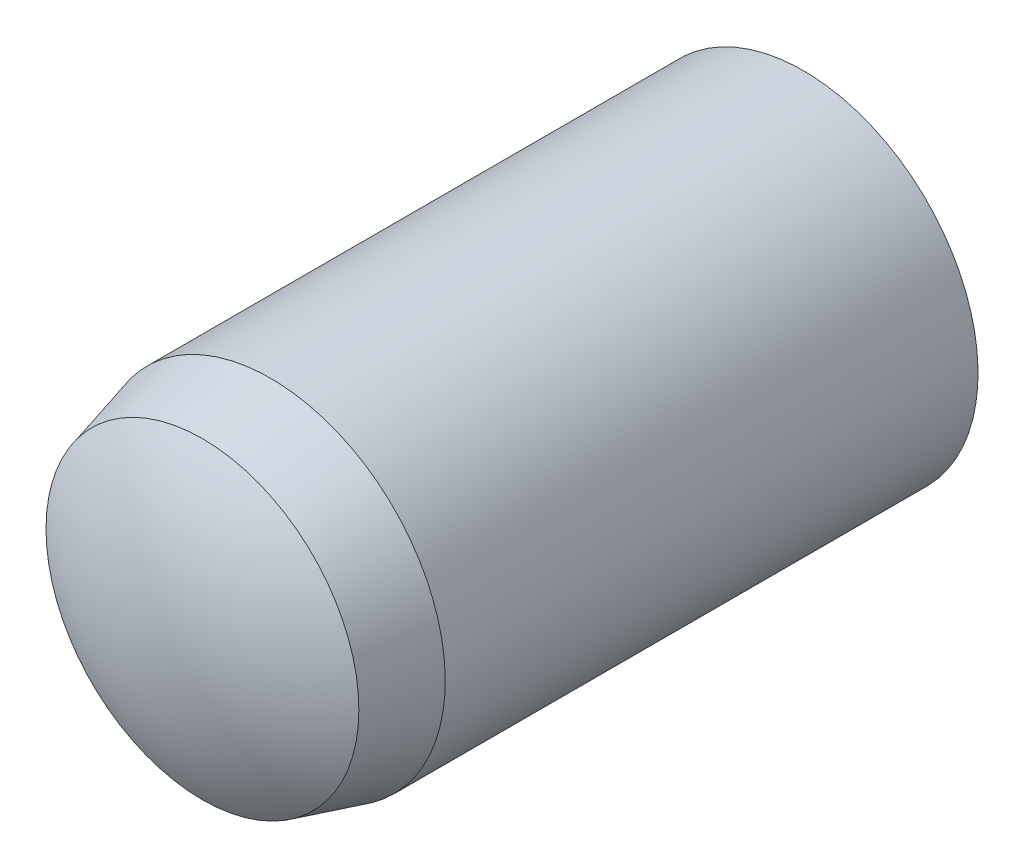
ISO-10303-21;
HEADER;
FILE_DESCRIPTION(('STEP AP214'),'2;1');
FILE_NAME('part.step','',(''),(''),'','','');
FILE_SCHEMA(('AUTOMOTIVE_DESIGN { 1 0 10303 214 1 1 1 1 }'));
ENDSEC;
DATA;
#1=APPLICATION_CONTEXT('core data for automotive mechanical design processes');
#2=APPLICATION_PROTOCOL_DEFINITION('international standard','automotive_design',2000,#1);
#3=PRODUCT_CONTEXT('',#1,'mechanical');
#4=PRODUCT('Part','Part','',(#3));
#5=PRODUCT_RELATED_PRODUCT_CATEGORY('part','',(#4));
#6=PRODUCT_DEFINITION_FORMATION('','',#4);
#7=PRODUCT_DEFINITION_CONTEXT('part definition',#1,'design');
#8=PRODUCT_DEFINITION('design','',#6,#7);
#9=PRODUCT_DEFINITION_SHAPE('','',#8);
#10=(LENGTH_UNIT() NAMED_UNIT(*) SI_UNIT(.MILLI.,.METRE.));
#11=(NAMED_UNIT(*) PLANE_ANGLE_UNIT() SI_UNIT($,.RADIAN.));
#12=(NAMED_UNIT(*) SI_UNIT($,.STERADIAN.) SOLID_ANGLE_UNIT());
#13=UNCERTAINTY_MEASURE_WITH_UNIT(LENGTH_MEASURE(1.E-05),#10,'distance_accuracy_value','');
#14=(GEOMETRIC_REPRESENTATION_CONTEXT(3) GLOBAL_UNCERTAINTY_ASSIGNED_CONTEXT((#13)) GLOBAL_UNIT_ASSIGNED_CONTEXT((#10,
#11,#12)) REPRESENTATION_CONTEXT('',''));
#15=CARTESIAN_POINT('',(0.,0.,0.));
#16=DIRECTION('',(0.,0.,1.));
#17=DIRECTION('',(1.,0.,0.));
#18=AXIS2_PLACEMENT_3D('',#15,#16,#17);
#19=CARTESIAN_POINT('',(0.,0.,-0.275000000000005));
#20=DIRECTION('',(0.,0.,1.));
#21=DIRECTION('',(0.,-1.,0.));
#22=AXIS2_PLACEMENT_3D('',#19,#20,#21);
#23=SPHERICAL_SURFACE('',#22,2.725);
#24=CARTESIAN_POINT('',(0.,0.,-2.55));
#25=DIRECTION('',(0.,0.,1.));
#26=DIRECTION('',(0.,-1.,0.));
#27=AXIS2_PLACEMENT_3D('',#24,#25,#26);
#28=CIRCLE('',#27,1.5);
#29=CARTESIAN_POINT('',(0.,-1.5,-2.55));
#30=VERTEX_POINT('',#29);
#31=EDGE_CURVE('E10',#30,#30,#28,.T.);
#32=ORIENTED_EDGE('',*,*,#31,.F.);
#33=EDGE_LOOP('',(#32));
#34=FACE_BOUND('',#33,.T.);
#35=ADVANCED_FACE('F43',(#34),#23,.T.);
#36=CARTESIAN_POINT('',(0.,0.,3.));
#37=DIRECTION('',(0.,0.,1.));
#38=DIRECTION('',(0.,-1.,0.));
#39=AXIS2_PLACEMENT_3D('',#36,#37,#38);
#40=CYLINDRICAL_SURFACE('',#39,1.5);
#41=CARTESIAN_POINT('',(0.,0.,2.025));
#42=DIRECTION('',(0.,0.,1.));
#43=DIRECTION('',(0.,-1.,0.));
#44=AXIS2_PLACEMENT_3D('',#41,#42,#43);
#45=CIRCLE('',#44,1.5);
#46=CARTESIAN_POINT('',(0.,-1.5,2.025));
#47=VERTEX_POINT('',#46);
#48=EDGE_CURVE('E50',#47,#47,#45,.T.);
#49=ORIENTED_EDGE('',*,*,#48,.F.);
#50=EDGE_LOOP('',(#49));
#51=FACE_BOUND('',#50,.T.);
#52=ORIENTED_EDGE('',*,*,#31,.T.);
#53=EDGE_LOOP('',(#52));
#54=FACE_BOUND('',#53,.T.);
#55=ADVANCED_FACE('F67',(#51,#54),#40,.T.);
#56=CARTESIAN_POINT('',(0.,0.,2.025));
#57=DIRECTION('',(0.,0.,-1.));
#58=DIRECTION('',(0.,1.,0.));
#59=AXIS2_PLACEMENT_3D('',#56,#57,#58);
#60=CONICAL_SURFACE('',#59,1.5,0.261799387799151);
#61=CARTESIAN_POINT('',(0.,0.,2.61));
#62=DIRECTION('',(0.,0.,1.));
#63=DIRECTION('',(0.,-1.,0.));
#64=AXIS2_PLACEMENT_3D('',#61,#62,#63);
#65=CIRCLE('',#64,1.34324972242779);
#66=CARTESIAN_POINT('',(0.,-1.34324972242779,2.61));
#67=VERTEX_POINT('',#66);
#68=EDGE_CURVE('E55',#67,#67,#65,.T.);
#69=ORIENTED_EDGE('',*,*,#68,.F.);
#70=EDGE_LOOP('',(#69));
#71=FACE_BOUND('',#70,.T.);
#72=ORIENTED_EDGE('',*,*,#48,.T.);
#73=EDGE_LOOP('',(#72));
#74=FACE_BOUND('',#73,.T.);
#75=ADVANCED_FACE('F65',(#71,#74),#60,.T.);
#76=CARTESIAN_POINT('',(0.,0.,0.491769465638023));
#77=DIRECTION('',(0.,0.,1.));
#78=DIRECTION('',(0.,1.,0.));
#79=AXIS2_PLACEMENT_3D('',#76,#77,#78);
#80=SPHERICAL_SURFACE('',#79,2.50823053436198);
#81=ORIENTED_EDGE('',*,*,#68,.T.);
#82=EDGE_LOOP('',(#81));
#83=FACE_BOUND('',#82,.T.);
#84=ADVANCED_FACE('F63',(#83),#80,.T.);
#85=CLOSED_SHELL('',(#35,#55,#75,#84));
#86=MANIFOLD_SOLID_BREP('B2',#85);
#87=ADVANCED_BREP_SHAPE_REPRESENTATION('',(#18,#86),#14);
#88=SHAPE_DEFINITION_REPRESENTATION(#9,#87);
ENDSEC;
END-ISO-10303-21;
